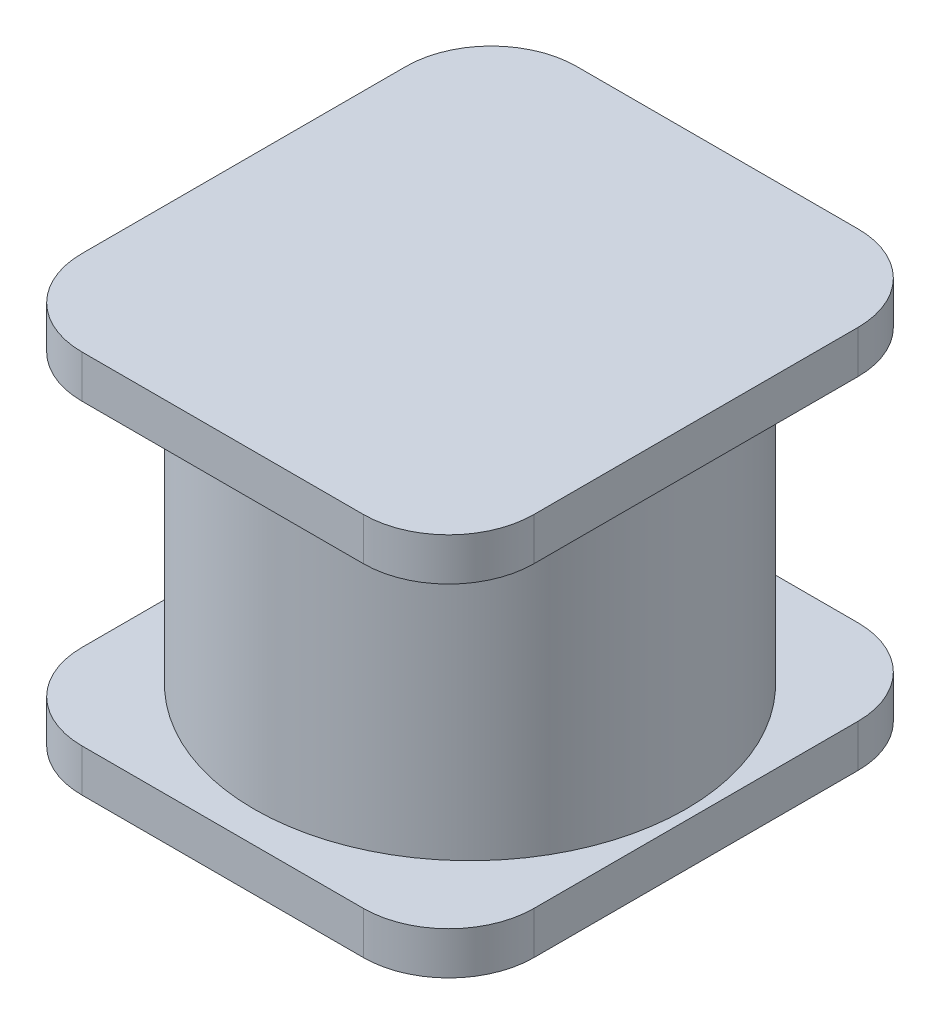
ISO-10303-21;
HEADER;
FILE_DESCRIPTION(('STEP AP214'),'2;1');
FILE_NAME('part.step','',(''),(''),'','','');
FILE_SCHEMA(('AUTOMOTIVE_DESIGN { 1 0 10303 214 1 1 1 1 }'));
ENDSEC;
DATA;
#1=APPLICATION_CONTEXT('core data for automotive mechanical design processes');
#2=APPLICATION_PROTOCOL_DEFINITION('international standard','automotive_design',2000,#1);
#3=PRODUCT_CONTEXT('',#1,'mechanical');
#4=PRODUCT('Part','Part','',(#3));
#5=PRODUCT_RELATED_PRODUCT_CATEGORY('part','',(#4));
#6=PRODUCT_DEFINITION_FORMATION('','',#4);
#7=PRODUCT_DEFINITION_CONTEXT('part definition',#1,'design');
#8=PRODUCT_DEFINITION('design','',#6,#7);
#9=PRODUCT_DEFINITION_SHAPE('','',#8);
#10=(LENGTH_UNIT() NAMED_UNIT(*) SI_UNIT(.MILLI.,.METRE.));
#11=(NAMED_UNIT(*) PLANE_ANGLE_UNIT() SI_UNIT($,.RADIAN.));
#12=(NAMED_UNIT(*) SI_UNIT($,.STERADIAN.) SOLID_ANGLE_UNIT());
#13=UNCERTAINTY_MEASURE_WITH_UNIT(LENGTH_MEASURE(1.E-05),#10,'distance_accuracy_value','');
#14=(GEOMETRIC_REPRESENTATION_CONTEXT(3) GLOBAL_UNCERTAINTY_ASSIGNED_CONTEXT((#13)) GLOBAL_UNIT_ASSIGNED_CONTEXT((#10,
#11,#12)) REPRESENTATION_CONTEXT('',''));
#15=CARTESIAN_POINT('',(0.,0.,0.));
#16=DIRECTION('',(0.,0.,1.));
#17=DIRECTION('',(1.,0.,0.));
#18=AXIS2_PLACEMENT_3D('',#15,#16,#17);
#19=CARTESIAN_POINT('',(2.65,0.5,-2.9));
#20=DIRECTION('',(0.,-1.,0.));
#21=DIRECTION('',(0.,0.,-1.));
#22=AXIS2_PLACEMENT_3D('',#19,#20,#21);
#23=PLANE('',#22);
#24=DIRECTION('',(0.,0.,-1.));
#25=VECTOR('',#24,1.);
#26=CARTESIAN_POINT('',(2.65,0.5,2.9));
#27=LINE('',#26,#25);
#28=CARTESIAN_POINT('',(2.65,0.5,1.9));
#29=VERTEX_POINT('',#28);
#30=CARTESIAN_POINT('',(2.65,0.5,-1.9));
#31=VERTEX_POINT('',#30);
#32=EDGE_CURVE('E187',#29,#31,#27,.T.);
#33=ORIENTED_EDGE('',*,*,#32,.T.);
#34=CARTESIAN_POINT('',(1.65,0.5,-1.9));
#35=DIRECTION('',(0.,-1.,0.));
#36=DIRECTION('',(0.,0.,-1.));
#37=AXIS2_PLACEMENT_3D('',#34,#35,#36);
#38=CIRCLE('',#37,1.);
#39=CARTESIAN_POINT('',(1.65,0.5,-2.9));
#40=VERTEX_POINT('',#39);
#41=EDGE_CURVE('E206',#31,#40,#38,.F.);
#42=ORIENTED_EDGE('',*,*,#41,.T.);
#43=DIRECTION('',(-1.,0.,0.));
#44=VECTOR('',#43,1.);
#45=CARTESIAN_POINT('',(-2.65,0.5,-2.9));
#46=LINE('',#45,#44);
#47=CARTESIAN_POINT('',(-1.65,0.5,-2.9));
#48=VERTEX_POINT('',#47);
#49=EDGE_CURVE('E169',#40,#48,#46,.T.);
#50=ORIENTED_EDGE('',*,*,#49,.T.);
#51=CARTESIAN_POINT('',(-1.65,0.5,-1.9));
#52=DIRECTION('',(0.,-1.,0.));
#53=DIRECTION('',(0.,0.,-1.));
#54=AXIS2_PLACEMENT_3D('',#51,#52,#53);
#55=CIRCLE('',#54,1.);
#56=CARTESIAN_POINT('',(-2.65,0.5,-1.9));
#57=VERTEX_POINT('',#56);
#58=EDGE_CURVE('E200',#48,#57,#55,.F.);
#59=ORIENTED_EDGE('',*,*,#58,.T.);
#60=DIRECTION('',(0.,0.,1.));
#61=VECTOR('',#60,1.);
#62=CARTESIAN_POINT('',(-2.65,0.5,2.9));
#63=LINE('',#62,#61);
#64=CARTESIAN_POINT('',(-2.65,0.5,1.9));
#65=VERTEX_POINT('',#64);
#66=EDGE_CURVE('E281',#57,#65,#63,.T.);
#67=ORIENTED_EDGE('',*,*,#66,.T.);
#68=CARTESIAN_POINT('',(-1.65,0.5,1.9));
#69=DIRECTION('',(0.,-1.,0.));
#70=DIRECTION('',(0.,0.,-1.));
#71=AXIS2_PLACEMENT_3D('',#68,#69,#70);
#72=CIRCLE('',#71,1.);
#73=CARTESIAN_POINT('',(-1.65,0.5,2.9));
#74=VERTEX_POINT('',#73);
#75=EDGE_CURVE('E202',#65,#74,#72,.F.);
#76=ORIENTED_EDGE('',*,*,#75,.T.);
#77=DIRECTION('',(1.,0.,0.));
#78=VECTOR('',#77,1.);
#79=CARTESIAN_POINT('',(-2.65,0.5,2.9));
#80=LINE('',#79,#78);
#81=CARTESIAN_POINT('',(1.65,0.5,2.9));
#82=VERTEX_POINT('',#81);
#83=EDGE_CURVE('E191',#74,#82,#80,.T.);
#84=ORIENTED_EDGE('',*,*,#83,.T.);
#85=CARTESIAN_POINT('',(1.65,0.5,1.9));
#86=DIRECTION('',(0.,-1.,0.));
#87=DIRECTION('',(0.,0.,-1.));
#88=AXIS2_PLACEMENT_3D('',#85,#86,#87);
#89=CIRCLE('',#88,1.);
#90=EDGE_CURVE('E204',#82,#29,#89,.F.);
#91=ORIENTED_EDGE('',*,*,#90,.T.);
#92=EDGE_LOOP('',(#33,#42,#50,#59,#67,#76,#84,#91));
#93=FACE_BOUND('',#92,.T.);
#94=CARTESIAN_POINT('',(0.,0.5,0.));
#95=DIRECTION('',(0.,-1.,0.));
#96=DIRECTION('',(0.,0.,-1.));
#97=AXIS2_PLACEMENT_3D('',#94,#95,#96);
#98=CIRCLE('',#97,2.53339916775663);
#99=CARTESIAN_POINT('',(0.,0.5,-2.53339916775663));
#100=VERTEX_POINT('',#99);
#101=EDGE_CURVE('E188',#100,#100,#98,.F.);
#102=ORIENTED_EDGE('',*,*,#101,.F.);
#103=EDGE_LOOP('',(#102));
#104=FACE_BOUND('',#103,.T.);
#105=ADVANCED_FACE('F35',(#93,#104),#23,.F.);
#106=CARTESIAN_POINT('',(2.65,0.5,2.9));
#107=DIRECTION('',(-1.,0.,0.));
#108=DIRECTION('',(0.,0.,1.));
#109=AXIS2_PLACEMENT_3D('',#106,#107,#108);
#110=PLANE('',#109);
#111=DIRECTION('',(0.,0.,-1.));
#112=VECTOR('',#111,1.);
#113=CARTESIAN_POINT('',(2.65,0.,2.9));
#114=LINE('',#113,#112);
#115=CARTESIAN_POINT('',(2.65,0.,1.9));
#116=VERTEX_POINT('',#115);
#117=CARTESIAN_POINT('',(2.65,0.,-1.9));
#118=VERTEX_POINT('',#117);
#119=EDGE_CURVE('E176',#116,#118,#114,.T.);
#120=ORIENTED_EDGE('',*,*,#119,.T.);
#121=DIRECTION('',(0.,-1.,0.));
#122=VECTOR('',#121,1.);
#123=CARTESIAN_POINT('',(2.65,0.5,-1.9));
#124=LINE('',#123,#122);
#125=EDGE_CURVE('E154',#118,#31,#124,.F.);
#126=ORIENTED_EDGE('',*,*,#125,.T.);
#127=ORIENTED_EDGE('',*,*,#32,.F.);
#128=DIRECTION('',(0.,-1.,0.));
#129=VECTOR('',#128,1.);
#130=CARTESIAN_POINT('',(2.65,0.5,1.9));
#131=LINE('',#130,#129);
#132=EDGE_CURVE('E159',#29,#116,#131,.T.);
#133=ORIENTED_EDGE('',*,*,#132,.T.);
#134=EDGE_LOOP('',(#120,#126,#127,#133));
#135=FACE_BOUND('',#134,.T.);
#136=ADVANCED_FACE('F297',(#135),#110,.F.);
#137=CARTESIAN_POINT('',(-2.65,0.5,-2.9));
#138=DIRECTION('',(0.,0.,1.));
#139=DIRECTION('',(1.,0.,0.));
#140=AXIS2_PLACEMENT_3D('',#137,#138,#139);
#141=PLANE('',#140);
#142=ORIENTED_EDGE('',*,*,#49,.F.);
#143=DIRECTION('',(0.,-1.,0.));
#144=VECTOR('',#143,1.);
#145=CARTESIAN_POINT('',(1.65,0.5,-2.9));
#146=LINE('',#145,#144);
#147=CARTESIAN_POINT('',(1.65,0.,-2.9));
#148=VERTEX_POINT('',#147);
#149=EDGE_CURVE('E153',#40,#148,#146,.T.);
#150=ORIENTED_EDGE('',*,*,#149,.T.);
#151=DIRECTION('',(-1.,0.,0.));
#152=VECTOR('',#151,1.);
#153=CARTESIAN_POINT('',(-2.65,0.,-2.9));
#154=LINE('',#153,#152);
#155=CARTESIAN_POINT('',(-1.65,0.,-2.9));
#156=VERTEX_POINT('',#155);
#157=EDGE_CURVE('E166',#148,#156,#154,.T.);
#158=ORIENTED_EDGE('',*,*,#157,.T.);
#159=DIRECTION('',(0.,-1.,0.));
#160=VECTOR('',#159,1.);
#161=CARTESIAN_POINT('',(-1.65,0.5,-2.9));
#162=LINE('',#161,#160);
#163=EDGE_CURVE('E171',#156,#48,#162,.F.);
#164=ORIENTED_EDGE('',*,*,#163,.T.);
#165=EDGE_LOOP('',(#142,#150,#158,#164));
#166=FACE_BOUND('',#165,.T.);
#167=ADVANCED_FACE('F165',(#166),#141,.F.);
#168=CARTESIAN_POINT('',(-2.65,0.5,2.9));
#169=DIRECTION('',(1.,0.,0.));
#170=DIRECTION('',(0.,0.,-1.));
#171=AXIS2_PLACEMENT_3D('',#168,#169,#170);
#172=PLANE('',#171);
#173=DIRECTION('',(0.,0.,1.));
#174=VECTOR('',#173,1.);
#175=CARTESIAN_POINT('',(-2.65,0.,2.9));
#176=LINE('',#175,#174);
#177=CARTESIAN_POINT('',(-2.65,0.,-1.9));
#178=VERTEX_POINT('',#177);
#179=CARTESIAN_POINT('',(-2.65,0.,1.9));
#180=VERTEX_POINT('',#179);
#181=EDGE_CURVE('E175',#178,#180,#176,.T.);
#182=ORIENTED_EDGE('',*,*,#181,.T.);
#183=DIRECTION('',(0.,-1.,0.));
#184=VECTOR('',#183,1.);
#185=CARTESIAN_POINT('',(-2.65,0.5,1.9));
#186=LINE('',#185,#184);
#187=EDGE_CURVE('E216',#180,#65,#186,.F.);
#188=ORIENTED_EDGE('',*,*,#187,.T.);
#189=ORIENTED_EDGE('',*,*,#66,.F.);
#190=DIRECTION('',(0.,-1.,0.));
#191=VECTOR('',#190,1.);
#192=CARTESIAN_POINT('',(-2.65,0.5,-1.9));
#193=LINE('',#192,#191);
#194=EDGE_CURVE('E213',#57,#178,#193,.T.);
#195=ORIENTED_EDGE('',*,*,#194,.T.);
#196=EDGE_LOOP('',(#182,#188,#189,#195));
#197=FACE_BOUND('',#196,.T.);
#198=ADVANCED_FACE('F304',(#197),#172,.F.);
#199=CARTESIAN_POINT('',(-2.65,0.5,2.9));
#200=DIRECTION('',(0.,0.,-1.));
#201=DIRECTION('',(-1.,0.,0.));
#202=AXIS2_PLACEMENT_3D('',#199,#200,#201);
#203=PLANE('',#202);
#204=DIRECTION('',(1.,0.,0.));
#205=VECTOR('',#204,1.);
#206=CARTESIAN_POINT('',(-2.65,0.,2.9));
#207=LINE('',#206,#205);
#208=CARTESIAN_POINT('',(-1.65,0.,2.9));
#209=VERTEX_POINT('',#208);
#210=CARTESIAN_POINT('',(1.65,0.,2.9));
#211=VERTEX_POINT('',#210);
#212=EDGE_CURVE('E179',#209,#211,#207,.T.);
#213=ORIENTED_EDGE('',*,*,#212,.T.);
#214=DIRECTION('',(0.,-1.,0.));
#215=VECTOR('',#214,1.);
#216=CARTESIAN_POINT('',(1.65,0.5,2.9));
#217=LINE('',#216,#215);
#218=EDGE_CURVE('E211',#211,#82,#217,.F.);
#219=ORIENTED_EDGE('',*,*,#218,.T.);
#220=ORIENTED_EDGE('',*,*,#83,.F.);
#221=DIRECTION('',(0.,-1.,0.));
#222=VECTOR('',#221,1.);
#223=CARTESIAN_POINT('',(-1.65,0.5,2.9));
#224=LINE('',#223,#222);
#225=EDGE_CURVE('E208',#74,#209,#224,.T.);
#226=ORIENTED_EDGE('',*,*,#225,.T.);
#227=EDGE_LOOP('',(#213,#219,#220,#226));
#228=FACE_BOUND('',#227,.T.);
#229=ADVANCED_FACE('F299',(#228),#203,.F.);
#230=CARTESIAN_POINT('',(2.65,0.,-2.9));
#231=DIRECTION('',(0.,-1.,0.));
#232=DIRECTION('',(0.,0.,-1.));
#233=AXIS2_PLACEMENT_3D('',#230,#231,#232);
#234=PLANE('',#233);
#235=ORIENTED_EDGE('',*,*,#157,.F.);
#236=CARTESIAN_POINT('',(1.65,0.,-1.9));
#237=DIRECTION('',(0.,-1.,0.));
#238=DIRECTION('',(0.,0.,-1.));
#239=AXIS2_PLACEMENT_3D('',#236,#237,#238);
#240=CIRCLE('',#239,1.);
#241=EDGE_CURVE('E149',#148,#118,#240,.T.);
#242=ORIENTED_EDGE('',*,*,#241,.T.);
#243=ORIENTED_EDGE('',*,*,#119,.F.);
#244=CARTESIAN_POINT('',(1.65,0.,1.9));
#245=DIRECTION('',(0.,-1.,0.));
#246=DIRECTION('',(0.,0.,-1.));
#247=AXIS2_PLACEMENT_3D('',#244,#245,#246);
#248=CIRCLE('',#247,1.);
#249=EDGE_CURVE('E160',#116,#211,#248,.T.);
#250=ORIENTED_EDGE('',*,*,#249,.T.);
#251=ORIENTED_EDGE('',*,*,#212,.F.);
#252=CARTESIAN_POINT('',(-1.65,0.,1.9));
#253=DIRECTION('',(0.,-1.,0.));
#254=DIRECTION('',(0.,0.,-1.));
#255=AXIS2_PLACEMENT_3D('',#252,#253,#254);
#256=CIRCLE('',#255,1.);
#257=EDGE_CURVE('E194',#209,#180,#256,.T.);
#258=ORIENTED_EDGE('',*,*,#257,.T.);
#259=ORIENTED_EDGE('',*,*,#181,.F.);
#260=CARTESIAN_POINT('',(-1.65,0.,-1.9));
#261=DIRECTION('',(0.,-1.,0.));
#262=DIRECTION('',(0.,0.,-1.));
#263=AXIS2_PLACEMENT_3D('',#260,#261,#262);
#264=CIRCLE('',#263,1.);
#265=EDGE_CURVE('E170',#178,#156,#264,.T.);
#266=ORIENTED_EDGE('',*,*,#265,.T.);
#267=EDGE_LOOP('',(#235,#242,#243,#250,#251,#258,#259,#266));
#268=FACE_BOUND('',#267,.T.);
#269=ADVANCED_FACE('F173',(#268),#234,.T.);
#270=CARTESIAN_POINT('',(0.,4.,0.));
#271=DIRECTION('',(0.,-1.,0.));
#272=DIRECTION('',(0.,0.,-1.));
#273=AXIS2_PLACEMENT_3D('',#270,#271,#272);
#274=CYLINDRICAL_SURFACE('',#273,2.53339916775663);
#275=CARTESIAN_POINT('',(0.,4.,0.));
#276=DIRECTION('',(0.,1.,0.));
#277=DIRECTION('',(0.,0.,1.));
#278=AXIS2_PLACEMENT_3D('',#275,#276,#277);
#279=CIRCLE('',#278,2.53339916775663);
#280=CARTESIAN_POINT('',(0.,4.,2.53339916775663));
#281=VERTEX_POINT('',#280);
#282=EDGE_CURVE('E181',#281,#281,#279,.T.);
#283=ORIENTED_EDGE('',*,*,#282,.F.);
#284=EDGE_LOOP('',(#283));
#285=FACE_BOUND('',#284,.T.);
#286=ORIENTED_EDGE('',*,*,#101,.T.);
#287=EDGE_LOOP('',(#286));
#288=FACE_BOUND('',#287,.T.);
#289=ADVANCED_FACE('F329',(#285,#288),#274,.T.);
#290=CARTESIAN_POINT('',(-2.65,4.,2.9));
#291=DIRECTION('',(0.,1.,0.));
#292=DIRECTION('',(0.,0.,1.));
#293=AXIS2_PLACEMENT_3D('',#290,#291,#292);
#294=PLANE('',#293);
#295=DIRECTION('',(0.,0.,1.));
#296=VECTOR('',#295,1.);
#297=CARTESIAN_POINT('',(-2.65,4.,-2.9));
#298=LINE('',#297,#296);
#299=CARTESIAN_POINT('',(-2.65,4.,-1.9));
#300=VERTEX_POINT('',#299);
#301=CARTESIAN_POINT('',(-2.65,4.,1.9));
#302=VERTEX_POINT('',#301);
#303=EDGE_CURVE('E265',#300,#302,#298,.T.);
#304=ORIENTED_EDGE('',*,*,#303,.F.);
#305=CARTESIAN_POINT('',(-1.65,4.,-1.9));
#306=DIRECTION('',(0.,1.,0.));
#307=DIRECTION('',(0.,0.,1.));
#308=AXIS2_PLACEMENT_3D('',#305,#306,#307);
#309=CIRCLE('',#308,1.);
#310=CARTESIAN_POINT('',(-1.65,4.,-2.9));
#311=VERTEX_POINT('',#310);
#312=EDGE_CURVE('E229',#300,#311,#309,.F.);
#313=ORIENTED_EDGE('',*,*,#312,.T.);
#314=DIRECTION('',(-1.,0.,0.));
#315=VECTOR('',#314,1.);
#316=CARTESIAN_POINT('',(-2.65,4.,-2.9));
#317=LINE('',#316,#315);
#318=CARTESIAN_POINT('',(1.65,4.,-2.9));
#319=VERTEX_POINT('',#318);
#320=EDGE_CURVE('E267',#319,#311,#317,.T.);
#321=ORIENTED_EDGE('',*,*,#320,.F.);
#322=CARTESIAN_POINT('',(1.65,4.,-1.9));
#323=DIRECTION('',(0.,1.,0.));
#324=DIRECTION('',(0.,0.,1.));
#325=AXIS2_PLACEMENT_3D('',#322,#323,#324);
#326=CIRCLE('',#325,1.);
#327=CARTESIAN_POINT('',(2.65,4.,-1.9));
#328=VERTEX_POINT('',#327);
#329=EDGE_CURVE('E227',#319,#328,#326,.F.);
#330=ORIENTED_EDGE('',*,*,#329,.T.);
#331=DIRECTION('',(0.,0.,-1.));
#332=VECTOR('',#331,1.);
#333=CARTESIAN_POINT('',(2.65,4.,-2.9));
#334=LINE('',#333,#332);
#335=CARTESIAN_POINT('',(2.65,4.,1.9));
#336=VERTEX_POINT('',#335);
#337=EDGE_CURVE('E264',#336,#328,#334,.T.);
#338=ORIENTED_EDGE('',*,*,#337,.F.);
#339=CARTESIAN_POINT('',(1.65,4.,1.9));
#340=DIRECTION('',(0.,1.,0.));
#341=DIRECTION('',(0.,0.,1.));
#342=AXIS2_PLACEMENT_3D('',#339,#340,#341);
#343=CIRCLE('',#342,1.);
#344=CARTESIAN_POINT('',(1.65,4.,2.9));
#345=VERTEX_POINT('',#344);
#346=EDGE_CURVE('E225',#336,#345,#343,.F.);
#347=ORIENTED_EDGE('',*,*,#346,.T.);
#348=DIRECTION('',(1.,0.,0.));
#349=VECTOR('',#348,1.);
#350=CARTESIAN_POINT('',(-2.65,4.,2.9));
#351=LINE('',#350,#349);
#352=CARTESIAN_POINT('',(-1.65,4.,2.9));
#353=VERTEX_POINT('',#352);
#354=EDGE_CURVE('E253',#353,#345,#351,.T.);
#355=ORIENTED_EDGE('',*,*,#354,.F.);
#356=CARTESIAN_POINT('',(-1.65,4.,1.9));
#357=DIRECTION('',(0.,1.,0.));
#358=DIRECTION('',(0.,0.,1.));
#359=AXIS2_PLACEMENT_3D('',#356,#357,#358);
#360=CIRCLE('',#359,1.);
#361=EDGE_CURVE('E223',#353,#302,#360,.F.);
#362=ORIENTED_EDGE('',*,*,#361,.T.);
#363=EDGE_LOOP('',(#304,#313,#321,#330,#338,#347,#355,#362));
#364=FACE_BOUND('',#363,.T.);
#365=ORIENTED_EDGE('',*,*,#282,.T.);
#366=EDGE_LOOP('',(#365));
#367=FACE_BOUND('',#366,.T.);
#368=ADVANCED_FACE('F260',(#364,#367),#294,.F.);
#369=CARTESIAN_POINT('',(-2.65,4.5,-2.9));
#370=DIRECTION('',(1.,0.,0.));
#371=DIRECTION('',(0.,0.,-1.));
#372=AXIS2_PLACEMENT_3D('',#369,#370,#371);
#373=PLANE('',#372);
#374=DIRECTION('',(0.,0.,1.));
#375=VECTOR('',#374,1.);
#376=CARTESIAN_POINT('',(-2.65,4.5,-2.9));
#377=LINE('',#376,#375);
#378=CARTESIAN_POINT('',(-2.65,4.5,-1.9));
#379=VERTEX_POINT('',#378);
#380=CARTESIAN_POINT('',(-2.65,4.5,1.9));
#381=VERTEX_POINT('',#380);
#382=EDGE_CURVE('E274',#379,#381,#377,.T.);
#383=ORIENTED_EDGE('',*,*,#382,.F.);
#384=DIRECTION('',(0.,-1.,0.));
#385=VECTOR('',#384,1.);
#386=CARTESIAN_POINT('',(-2.65,4.5,-1.9));
#387=LINE('',#386,#385);
#388=EDGE_CURVE('E220',#379,#300,#387,.T.);
#389=ORIENTED_EDGE('',*,*,#388,.T.);
#390=ORIENTED_EDGE('',*,*,#303,.T.);
#391=DIRECTION('',(0.,-1.,0.));
#392=VECTOR('',#391,1.);
#393=CARTESIAN_POINT('',(-2.65,4.5,1.9));
#394=LINE('',#393,#392);
#395=EDGE_CURVE('E218',#302,#381,#394,.F.);
#396=ORIENTED_EDGE('',*,*,#395,.T.);
#397=EDGE_LOOP('',(#383,#389,#390,#396));
#398=FACE_BOUND('',#397,.T.);
#399=ADVANCED_FACE('F407',(#398),#373,.F.);
#400=CARTESIAN_POINT('',(-2.65,4.5,2.9));
#401=DIRECTION('',(0.,0.,-1.));
#402=DIRECTION('',(-1.,0.,0.));
#403=AXIS2_PLACEMENT_3D('',#400,#401,#402);
#404=PLANE('',#403);
#405=ORIENTED_EDGE('',*,*,#354,.T.);
#406=DIRECTION('',(0.,-1.,0.));
#407=VECTOR('',#406,1.);
#408=CARTESIAN_POINT('',(1.65,4.5,2.9));
#409=LINE('',#408,#407);
#410=CARTESIAN_POINT('',(1.65,4.5,2.9));
#411=VERTEX_POINT('',#410);
#412=EDGE_CURVE('E11',#345,#411,#409,.F.);
#413=ORIENTED_EDGE('',*,*,#412,.T.);
#414=DIRECTION('',(1.,0.,0.));
#415=VECTOR('',#414,1.);
#416=CARTESIAN_POINT('',(-2.65,4.5,2.9));
#417=LINE('',#416,#415);
#418=CARTESIAN_POINT('',(-1.65,4.5,2.9));
#419=VERTEX_POINT('',#418);
#420=EDGE_CURVE('E255',#419,#411,#417,.T.);
#421=ORIENTED_EDGE('',*,*,#420,.F.);
#422=DIRECTION('',(0.,-1.,0.));
#423=VECTOR('',#422,1.);
#424=CARTESIAN_POINT('',(-1.65,4.5,2.9));
#425=LINE('',#424,#423);
#426=EDGE_CURVE('E43',#419,#353,#425,.T.);
#427=ORIENTED_EDGE('',*,*,#426,.T.);
#428=EDGE_LOOP('',(#405,#413,#421,#427));
#429=FACE_BOUND('',#428,.T.);
#430=ADVANCED_FACE('F252',(#429),#404,.F.);
#431=CARTESIAN_POINT('',(2.65,4.5,-2.9));
#432=DIRECTION('',(-1.,0.,0.));
#433=DIRECTION('',(0.,0.,1.));
#434=AXIS2_PLACEMENT_3D('',#431,#432,#433);
#435=PLANE('',#434);
#436=ORIENTED_EDGE('',*,*,#337,.T.);
#437=DIRECTION('',(0.,-1.,0.));
#438=VECTOR('',#437,1.);
#439=CARTESIAN_POINT('',(2.65,4.5,-1.9));
#440=LINE('',#439,#438);
#441=CARTESIAN_POINT('',(2.65,4.5,-1.9));
#442=VERTEX_POINT('',#441);
#443=EDGE_CURVE('E50',#328,#442,#440,.F.);
#444=ORIENTED_EDGE('',*,*,#443,.T.);
#445=DIRECTION('',(0.,0.,-1.));
#446=VECTOR('',#445,1.);
#447=CARTESIAN_POINT('',(2.65,4.5,-2.9));
#448=LINE('',#447,#446);
#449=CARTESIAN_POINT('',(2.65,4.5,1.9));
#450=VERTEX_POINT('',#449);
#451=EDGE_CURVE('E399',#450,#442,#448,.T.);
#452=ORIENTED_EDGE('',*,*,#451,.F.);
#453=DIRECTION('',(0.,-1.,0.));
#454=VECTOR('',#453,1.);
#455=CARTESIAN_POINT('',(2.65,4.5,1.9));
#456=LINE('',#455,#454);
#457=EDGE_CURVE('E243',#450,#336,#456,.T.);
#458=ORIENTED_EDGE('',*,*,#457,.T.);
#459=EDGE_LOOP('',(#436,#444,#452,#458));
#460=FACE_BOUND('',#459,.T.);
#461=ADVANCED_FACE('F410',(#460),#435,.F.);
#462=CARTESIAN_POINT('',(-2.65,4.5,-2.9));
#463=DIRECTION('',(0.,0.,1.));
#464=DIRECTION('',(1.,0.,0.));
#465=AXIS2_PLACEMENT_3D('',#462,#463,#464);
#466=PLANE('',#465);
#467=ORIENTED_EDGE('',*,*,#320,.T.);
#468=DIRECTION('',(0.,-1.,0.));
#469=VECTOR('',#468,1.);
#470=CARTESIAN_POINT('',(-1.65,4.5,-2.9));
#471=LINE('',#470,#469);
#472=CARTESIAN_POINT('',(-1.65,4.5,-2.9));
#473=VERTEX_POINT('',#472);
#474=EDGE_CURVE('E234',#311,#473,#471,.F.);
#475=ORIENTED_EDGE('',*,*,#474,.T.);
#476=DIRECTION('',(-1.,0.,0.));
#477=VECTOR('',#476,1.);
#478=CARTESIAN_POINT('',(-2.65,4.5,-2.9));
#479=LINE('',#478,#477);
#480=CARTESIAN_POINT('',(1.65,4.5,-2.9));
#481=VERTEX_POINT('',#480);
#482=EDGE_CURVE('E277',#481,#473,#479,.T.);
#483=ORIENTED_EDGE('',*,*,#482,.F.);
#484=DIRECTION('',(0.,-1.,0.));
#485=VECTOR('',#484,1.);
#486=CARTESIAN_POINT('',(1.65,4.5,-2.9));
#487=LINE('',#486,#485);
#488=EDGE_CURVE('E231',#481,#319,#487,.T.);
#489=ORIENTED_EDGE('',*,*,#488,.T.);
#490=EDGE_LOOP('',(#467,#475,#483,#489));
#491=FACE_BOUND('',#490,.T.);
#492=ADVANCED_FACE('F409',(#491),#466,.F.);
#493=CARTESIAN_POINT('',(-2.65,4.5,2.9));
#494=DIRECTION('',(0.,1.,0.));
#495=DIRECTION('',(0.,0.,1.));
#496=AXIS2_PLACEMENT_3D('',#493,#494,#495);
#497=PLANE('',#496);
#498=ORIENTED_EDGE('',*,*,#482,.T.);
#499=CARTESIAN_POINT('',(-1.65,4.5,-1.9));
#500=DIRECTION('',(0.,1.,0.));
#501=DIRECTION('',(0.,0.,1.));
#502=AXIS2_PLACEMENT_3D('',#499,#500,#501);
#503=CIRCLE('',#502,1.);
#504=EDGE_CURVE('E241',#473,#379,#503,.T.);
#505=ORIENTED_EDGE('',*,*,#504,.T.);
#506=ORIENTED_EDGE('',*,*,#382,.T.);
#507=CARTESIAN_POINT('',(-1.65,4.5,1.9));
#508=DIRECTION('',(0.,1.,0.));
#509=DIRECTION('',(0.,0.,1.));
#510=AXIS2_PLACEMENT_3D('',#507,#508,#509);
#511=CIRCLE('',#510,1.);
#512=EDGE_CURVE('E236',#381,#419,#511,.T.);
#513=ORIENTED_EDGE('',*,*,#512,.T.);
#514=ORIENTED_EDGE('',*,*,#420,.T.);
#515=CARTESIAN_POINT('',(1.65,4.5,1.9));
#516=DIRECTION('',(0.,1.,0.));
#517=DIRECTION('',(0.,0.,1.));
#518=AXIS2_PLACEMENT_3D('',#515,#516,#517);
#519=CIRCLE('',#518,1.);
#520=EDGE_CURVE('E57',#411,#450,#519,.T.);
#521=ORIENTED_EDGE('',*,*,#520,.T.);
#522=ORIENTED_EDGE('',*,*,#451,.T.);
#523=CARTESIAN_POINT('',(1.65,4.5,-1.9));
#524=DIRECTION('',(0.,1.,0.));
#525=DIRECTION('',(0.,0.,1.));
#526=AXIS2_PLACEMENT_3D('',#523,#524,#525);
#527=CIRCLE('',#526,1.);
#528=EDGE_CURVE('E239',#442,#481,#527,.T.);
#529=ORIENTED_EDGE('',*,*,#528,.T.);
#530=EDGE_LOOP('',(#498,#505,#506,#513,#514,#521,#522,#529));
#531=FACE_BOUND('',#530,.T.);
#532=ADVANCED_FACE('F341',(#531),#497,.T.);
#533=CARTESIAN_POINT('',(1.65,0.5,-1.9));
#534=DIRECTION('',(0.,-1.,0.));
#535=DIRECTION('',(0.,0.,-1.));
#536=AXIS2_PLACEMENT_3D('',#533,#534,#535);
#537=CYLINDRICAL_SURFACE('',#536,1.);
#538=ORIENTED_EDGE('',*,*,#41,.F.);
#539=ORIENTED_EDGE('',*,*,#125,.F.);
#540=ORIENTED_EDGE('',*,*,#241,.F.);
#541=ORIENTED_EDGE('',*,*,#149,.F.);
#542=EDGE_LOOP('',(#538,#539,#540,#541));
#543=FACE_BOUND('',#542,.T.);
#544=ADVANCED_FACE('F152',(#543),#537,.T.);
#545=CARTESIAN_POINT('',(1.65,0.5,1.9));
#546=DIRECTION('',(0.,-1.,0.));
#547=DIRECTION('',(0.,0.,-1.));
#548=AXIS2_PLACEMENT_3D('',#545,#546,#547);
#549=CYLINDRICAL_SURFACE('',#548,1.);
#550=ORIENTED_EDGE('',*,*,#90,.F.);
#551=ORIENTED_EDGE('',*,*,#218,.F.);
#552=ORIENTED_EDGE('',*,*,#249,.F.);
#553=ORIENTED_EDGE('',*,*,#132,.F.);
#554=EDGE_LOOP('',(#550,#551,#552,#553));
#555=FACE_BOUND('',#554,.T.);
#556=ADVANCED_FACE('F295',(#555),#549,.T.);
#557=CARTESIAN_POINT('',(-1.65,0.5,1.9));
#558=DIRECTION('',(0.,-1.,0.));
#559=DIRECTION('',(0.,0.,-1.));
#560=AXIS2_PLACEMENT_3D('',#557,#558,#559);
#561=CYLINDRICAL_SURFACE('',#560,1.);
#562=ORIENTED_EDGE('',*,*,#75,.F.);
#563=ORIENTED_EDGE('',*,*,#187,.F.);
#564=ORIENTED_EDGE('',*,*,#257,.F.);
#565=ORIENTED_EDGE('',*,*,#225,.F.);
#566=EDGE_LOOP('',(#562,#563,#564,#565));
#567=FACE_BOUND('',#566,.T.);
#568=ADVANCED_FACE('F301',(#567),#561,.T.);
#569=CARTESIAN_POINT('',(-1.65,0.5,-1.9));
#570=DIRECTION('',(0.,-1.,0.));
#571=DIRECTION('',(0.,0.,-1.));
#572=AXIS2_PLACEMENT_3D('',#569,#570,#571);
#573=CYLINDRICAL_SURFACE('',#572,1.);
#574=ORIENTED_EDGE('',*,*,#58,.F.);
#575=ORIENTED_EDGE('',*,*,#163,.F.);
#576=ORIENTED_EDGE('',*,*,#265,.F.);
#577=ORIENTED_EDGE('',*,*,#194,.F.);
#578=EDGE_LOOP('',(#574,#575,#576,#577));
#579=FACE_BOUND('',#578,.T.);
#580=ADVANCED_FACE('F309',(#579),#573,.T.);
#581=CARTESIAN_POINT('',(-1.65,4.5,-1.9));
#582=DIRECTION('',(0.,-1.,0.));
#583=DIRECTION('',(0.,0.,-1.));
#584=AXIS2_PLACEMENT_3D('',#581,#582,#583);
#585=CYLINDRICAL_SURFACE('',#584,1.);
#586=ORIENTED_EDGE('',*,*,#504,.F.);
#587=ORIENTED_EDGE('',*,*,#474,.F.);
#588=ORIENTED_EDGE('',*,*,#312,.F.);
#589=ORIENTED_EDGE('',*,*,#388,.F.);
#590=EDGE_LOOP('',(#586,#587,#588,#589));
#591=FACE_BOUND('',#590,.T.);
#592=ADVANCED_FACE('F311',(#591),#585,.T.);
#593=CARTESIAN_POINT('',(1.65,4.5,-1.9));
#594=DIRECTION('',(0.,-1.,0.));
#595=DIRECTION('',(0.,0.,-1.));
#596=AXIS2_PLACEMENT_3D('',#593,#594,#595);
#597=CYLINDRICAL_SURFACE('',#596,1.);
#598=ORIENTED_EDGE('',*,*,#528,.F.);
#599=ORIENTED_EDGE('',*,*,#443,.F.);
#600=ORIENTED_EDGE('',*,*,#329,.F.);
#601=ORIENTED_EDGE('',*,*,#488,.F.);
#602=EDGE_LOOP('',(#598,#599,#600,#601));
#603=FACE_BOUND('',#602,.T.);
#604=ADVANCED_FACE('F317',(#603),#597,.T.);
#605=CARTESIAN_POINT('',(1.65,4.5,1.9));
#606=DIRECTION('',(0.,-1.,0.));
#607=DIRECTION('',(0.,0.,-1.));
#608=AXIS2_PLACEMENT_3D('',#605,#606,#607);
#609=CYLINDRICAL_SURFACE('',#608,1.);
#610=ORIENTED_EDGE('',*,*,#520,.F.);
#611=ORIENTED_EDGE('',*,*,#412,.F.);
#612=ORIENTED_EDGE('',*,*,#346,.F.);
#613=ORIENTED_EDGE('',*,*,#457,.F.);
#614=EDGE_LOOP('',(#610,#611,#612,#613));
#615=FACE_BOUND('',#614,.T.);
#616=ADVANCED_FACE('F371',(#615),#609,.T.);
#617=CARTESIAN_POINT('',(-1.65,4.5,1.9));
#618=DIRECTION('',(0.,-1.,0.));
#619=DIRECTION('',(0.,0.,-1.));
#620=AXIS2_PLACEMENT_3D('',#617,#618,#619);
#621=CYLINDRICAL_SURFACE('',#620,1.);
#622=ORIENTED_EDGE('',*,*,#512,.F.);
#623=ORIENTED_EDGE('',*,*,#395,.F.);
#624=ORIENTED_EDGE('',*,*,#361,.F.);
#625=ORIENTED_EDGE('',*,*,#426,.F.);
#626=EDGE_LOOP('',(#622,#623,#624,#625));
#627=FACE_BOUND('',#626,.T.);
#628=ADVANCED_FACE('F37',(#627),#621,.T.);
#629=CLOSED_SHELL('',(#105,#136,#167,#198,#229,#269,#289,#368,#399,#430,#461,#492,#532,#544,
#556,#568,#580,#592,#604,#616,#628));
#630=MANIFOLD_SOLID_BREP('B2',#629);
#631=ADVANCED_BREP_SHAPE_REPRESENTATION('',(#18,#630),#14);
#632=SHAPE_DEFINITION_REPRESENTATION(#9,#631);
ENDSEC;
END-ISO-10303-21;
